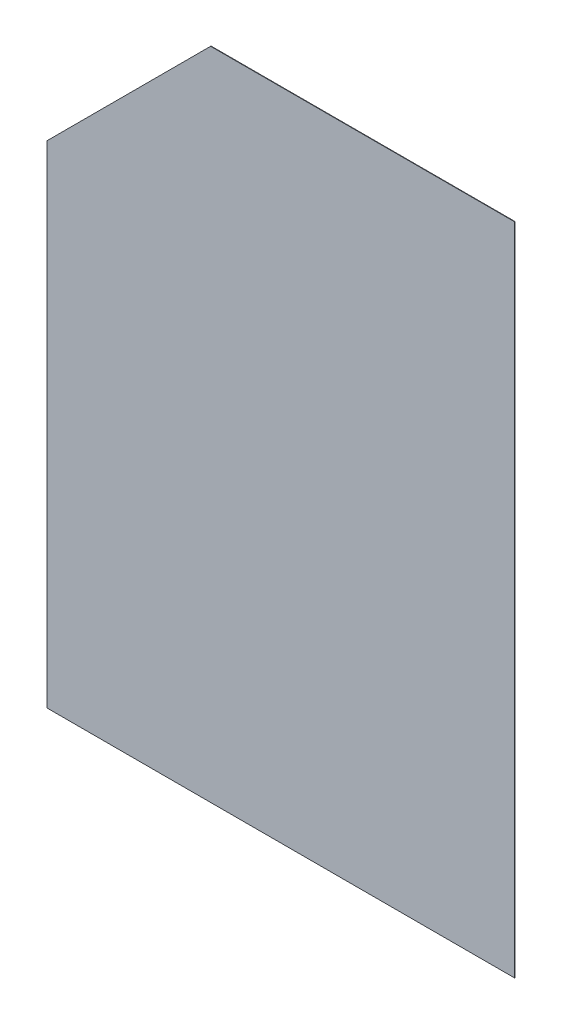
ISO-10303-21;
HEADER;
FILE_DESCRIPTION(('STEP AP214'),'2;1');
FILE_NAME('part.step','',(''),(''),'','','');
FILE_SCHEMA(('AUTOMOTIVE_DESIGN { 1 0 10303 214 1 1 1 1 }'));
ENDSEC;
DATA;
#1=APPLICATION_CONTEXT('core data for automotive mechanical design processes');
#2=APPLICATION_PROTOCOL_DEFINITION('international standard','automotive_design',2000,#1);
#3=PRODUCT_CONTEXT('',#1,'mechanical');
#4=PRODUCT('Part','Part','',(#3));
#5=PRODUCT_RELATED_PRODUCT_CATEGORY('part','',(#4));
#6=PRODUCT_DEFINITION_FORMATION('','',#4);
#7=PRODUCT_DEFINITION_CONTEXT('part definition',#1,'design');
#8=PRODUCT_DEFINITION('design','',#6,#7);
#9=PRODUCT_DEFINITION_SHAPE('','',#8);
#10=(LENGTH_UNIT() NAMED_UNIT(*) SI_UNIT(.MILLI.,.METRE.));
#11=(NAMED_UNIT(*) PLANE_ANGLE_UNIT() SI_UNIT($,.RADIAN.));
#12=(NAMED_UNIT(*) SI_UNIT($,.STERADIAN.) SOLID_ANGLE_UNIT());
#13=UNCERTAINTY_MEASURE_WITH_UNIT(LENGTH_MEASURE(1.E-05),#10,'distance_accuracy_value','');
#14=(GEOMETRIC_REPRESENTATION_CONTEXT(3) GLOBAL_UNCERTAINTY_ASSIGNED_CONTEXT((#13)) GLOBAL_UNIT_ASSIGNED_CONTEXT((#10,
#11,#12)) REPRESENTATION_CONTEXT('',''));
#15=CARTESIAN_POINT('',(0.,0.,0.));
#16=DIRECTION('',(0.,0.,1.));
#17=DIRECTION('',(1.,0.,0.));
#18=AXIS2_PLACEMENT_3D('',#15,#16,#17);
#19=CARTESIAN_POINT('',(0.,0.,0.001));
#20=DIRECTION('',(0.,0.,-1.));
#21=DIRECTION('',(0.,-1.,0.));
#22=AXIS2_PLACEMENT_3D('',#19,#20,#21);
#23=PLANE('',#22);
#24=DIRECTION('',(1.,0.,0.));
#25=VECTOR('',#24,1.);
#26=CARTESIAN_POINT('',(0.,0.,0.001));
#27=LINE('',#26,#25);
#28=CARTESIAN_POINT('',(0.,0.,0.001));
#29=VERTEX_POINT('',#28);
#30=CARTESIAN_POINT('',(1.,0.,0.001));
#31=VERTEX_POINT('',#30);
#32=EDGE_CURVE('E113',#29,#31,#27,.T.);
#33=ORIENTED_EDGE('',*,*,#32,.T.);
#34=DIRECTION('',(0.,1.,0.));
#35=VECTOR('',#34,1.);
#36=CARTESIAN_POINT('',(1.,0.,0.001));
#37=LINE('',#36,#35);
#38=CARTESIAN_POINT('',(1.,1.4,0.001));
#39=VERTEX_POINT('',#38);
#40=EDGE_CURVE('E96',#31,#39,#37,.T.);
#41=ORIENTED_EDGE('',*,*,#40,.T.);
#42=DIRECTION('',(-1.,0.,0.));
#43=VECTOR('',#42,1.);
#44=CARTESIAN_POINT('',(1.,1.4,0.001));
#45=LINE('',#44,#43);
#46=CARTESIAN_POINT('',(0.35,1.4,0.001));
#47=VERTEX_POINT('',#46);
#48=EDGE_CURVE('E83',#39,#47,#45,.T.);
#49=ORIENTED_EDGE('',*,*,#48,.T.);
#50=DIRECTION('',(-0.707106781186548,-0.707106781186548,0.));
#51=VECTOR('',#50,1.);
#52=CARTESIAN_POINT('',(0.35,1.4,0.001));
#53=LINE('',#52,#51);
#54=CARTESIAN_POINT('',(0.,1.05,0.001));
#55=VERTEX_POINT('',#54);
#56=EDGE_CURVE('E87',#47,#55,#53,.T.);
#57=ORIENTED_EDGE('',*,*,#56,.T.);
#58=DIRECTION('',(0.,-1.,0.));
#59=VECTOR('',#58,1.);
#60=CARTESIAN_POINT('',(0.,1.05,0.001));
#61=LINE('',#60,#59);
#62=EDGE_CURVE('E11',#55,#29,#61,.T.);
#63=ORIENTED_EDGE('',*,*,#62,.T.);
#64=EDGE_LOOP('',(#33,#41,#49,#57,#63));
#65=FACE_BOUND('',#64,.T.);
#66=ADVANCED_FACE('F16',(#65),#23,.F.);
#67=CARTESIAN_POINT('',(0.,0.,0.));
#68=DIRECTION('',(0.,0.,-1.));
#69=DIRECTION('',(0.,-1.,0.));
#70=AXIS2_PLACEMENT_3D('',#67,#68,#69);
#71=PLANE('',#70);
#72=DIRECTION('',(1.,0.,0.));
#73=VECTOR('',#72,1.);
#74=CARTESIAN_POINT('',(0.,0.,0.));
#75=LINE('',#74,#73);
#76=CARTESIAN_POINT('',(0.,0.,0.));
#77=VERTEX_POINT('',#76);
#78=CARTESIAN_POINT('',(1.,0.,0.));
#79=VERTEX_POINT('',#78);
#80=EDGE_CURVE('E128',#77,#79,#75,.T.);
#81=ORIENTED_EDGE('',*,*,#80,.F.);
#82=DIRECTION('',(0.,-1.,0.));
#83=VECTOR('',#82,1.);
#84=CARTESIAN_POINT('',(0.,1.05,0.));
#85=LINE('',#84,#83);
#86=CARTESIAN_POINT('',(0.,1.05,0.));
#87=VERTEX_POINT('',#86);
#88=EDGE_CURVE('E27',#87,#77,#85,.T.);
#89=ORIENTED_EDGE('',*,*,#88,.F.);
#90=DIRECTION('',(-0.707106781186548,-0.707106781186548,0.));
#91=VECTOR('',#90,1.);
#92=CARTESIAN_POINT('',(0.35,1.4,0.));
#93=LINE('',#92,#91);
#94=CARTESIAN_POINT('',(0.35,1.4,0.));
#95=VERTEX_POINT('',#94);
#96=EDGE_CURVE('E20',#95,#87,#93,.T.);
#97=ORIENTED_EDGE('',*,*,#96,.F.);
#98=DIRECTION('',(-1.,0.,0.));
#99=VECTOR('',#98,1.);
#100=CARTESIAN_POINT('',(1.,1.4,0.));
#101=LINE('',#100,#99);
#102=CARTESIAN_POINT('',(1.,1.4,0.));
#103=VERTEX_POINT('',#102);
#104=EDGE_CURVE('E77',#103,#95,#101,.T.);
#105=ORIENTED_EDGE('',*,*,#104,.F.);
#106=DIRECTION('',(0.,1.,0.));
#107=VECTOR('',#106,1.);
#108=CARTESIAN_POINT('',(1.,0.,0.));
#109=LINE('',#108,#107);
#110=EDGE_CURVE('E111',#79,#103,#109,.T.);
#111=ORIENTED_EDGE('',*,*,#110,.F.);
#112=EDGE_LOOP('',(#81,#89,#97,#105,#111));
#113=FACE_BOUND('',#112,.T.);
#114=ADVANCED_FACE('F75',(#113),#71,.T.);
#115=CARTESIAN_POINT('',(0.,1.05,0.));
#116=DIRECTION('',(1.,0.,0.));
#117=DIRECTION('',(0.,1.,0.));
#118=AXIS2_PLACEMENT_3D('',#115,#116,#117);
#119=PLANE('',#118);
#120=DIRECTION('',(0.,0.,1.));
#121=VECTOR('',#120,1.);
#122=CARTESIAN_POINT('',(0.,1.05,0.));
#123=LINE('',#122,#121);
#124=EDGE_CURVE('E82',#87,#55,#123,.T.);
#125=ORIENTED_EDGE('',*,*,#124,.F.);
#126=ORIENTED_EDGE('',*,*,#88,.T.);
#127=DIRECTION('',(0.,0.,1.));
#128=VECTOR('',#127,1.);
#129=CARTESIAN_POINT('',(0.,0.,0.));
#130=LINE('',#129,#128);
#131=EDGE_CURVE('E106',#77,#29,#130,.T.);
#132=ORIENTED_EDGE('',*,*,#131,.T.);
#133=ORIENTED_EDGE('',*,*,#62,.F.);
#134=EDGE_LOOP('',(#125,#126,#132,#133));
#135=FACE_BOUND('',#134,.T.);
#136=ADVANCED_FACE('F151',(#135),#119,.F.);
#137=CARTESIAN_POINT('',(0.35,1.4,0.));
#138=DIRECTION('',(0.707106781186548,-0.707106781186548,0.));
#139=DIRECTION('',(0.,0.,-1.));
#140=AXIS2_PLACEMENT_3D('',#137,#138,#139);
#141=PLANE('',#140);
#142=DIRECTION('',(0.,0.,1.));
#143=VECTOR('',#142,1.);
#144=CARTESIAN_POINT('',(0.35,1.4,0.));
#145=LINE('',#144,#143);
#146=EDGE_CURVE('E85',#95,#47,#145,.T.);
#147=ORIENTED_EDGE('',*,*,#146,.F.);
#148=ORIENTED_EDGE('',*,*,#96,.T.);
#149=ORIENTED_EDGE('',*,*,#124,.T.);
#150=ORIENTED_EDGE('',*,*,#56,.F.);
#151=EDGE_LOOP('',(#147,#148,#149,#150));
#152=FACE_BOUND('',#151,.T.);
#153=ADVANCED_FACE('F86',(#152),#141,.F.);
#154=CARTESIAN_POINT('',(1.,1.4,0.));
#155=DIRECTION('',(0.,-1.,0.));
#156=DIRECTION('',(0.,0.,-1.));
#157=AXIS2_PLACEMENT_3D('',#154,#155,#156);
#158=PLANE('',#157);
#159=DIRECTION('',(0.,0.,1.));
#160=VECTOR('',#159,1.);
#161=CARTESIAN_POINT('',(1.,1.4,0.));
#162=LINE('',#161,#160);
#163=EDGE_CURVE('E93',#103,#39,#162,.T.);
#164=ORIENTED_EDGE('',*,*,#163,.F.);
#165=ORIENTED_EDGE('',*,*,#104,.T.);
#166=ORIENTED_EDGE('',*,*,#146,.T.);
#167=ORIENTED_EDGE('',*,*,#48,.F.);
#168=EDGE_LOOP('',(#164,#165,#166,#167));
#169=FACE_BOUND('',#168,.T.);
#170=ADVANCED_FACE('F18',(#169),#158,.F.);
#171=CARTESIAN_POINT('',(1.,0.,0.));
#172=DIRECTION('',(-1.,0.,0.));
#173=DIRECTION('',(0.,0.,1.));
#174=AXIS2_PLACEMENT_3D('',#171,#172,#173);
#175=PLANE('',#174);
#176=DIRECTION('',(0.,0.,1.));
#177=VECTOR('',#176,1.);
#178=CARTESIAN_POINT('',(1.,0.,0.));
#179=LINE('',#178,#177);
#180=EDGE_CURVE('E117',#79,#31,#179,.T.);
#181=ORIENTED_EDGE('',*,*,#180,.F.);
#182=ORIENTED_EDGE('',*,*,#110,.T.);
#183=ORIENTED_EDGE('',*,*,#163,.T.);
#184=ORIENTED_EDGE('',*,*,#40,.F.);
#185=EDGE_LOOP('',(#181,#182,#183,#184));
#186=FACE_BOUND('',#185,.T.);
#187=ADVANCED_FACE('F144',(#186),#175,.F.);
#188=CARTESIAN_POINT('',(0.,0.,0.));
#189=DIRECTION('',(0.,1.,0.));
#190=DIRECTION('',(1.,0.,0.));
#191=AXIS2_PLACEMENT_3D('',#188,#189,#190);
#192=PLANE('',#191);
#193=ORIENTED_EDGE('',*,*,#131,.F.);
#194=ORIENTED_EDGE('',*,*,#80,.T.);
#195=ORIENTED_EDGE('',*,*,#180,.T.);
#196=ORIENTED_EDGE('',*,*,#32,.F.);
#197=EDGE_LOOP('',(#193,#194,#195,#196));
#198=FACE_BOUND('',#197,.T.);
#199=ADVANCED_FACE('F141',(#198),#192,.F.);
#200=CLOSED_SHELL('',(#66,#114,#136,#153,#170,#187,#199));
#201=MANIFOLD_SOLID_BREP('B1',#200);
#202=ADVANCED_BREP_SHAPE_REPRESENTATION('',(#18,#201),#14);
#203=SHAPE_DEFINITION_REPRESENTATION(#9,#202);
ENDSEC;
END-ISO-10303-21;
